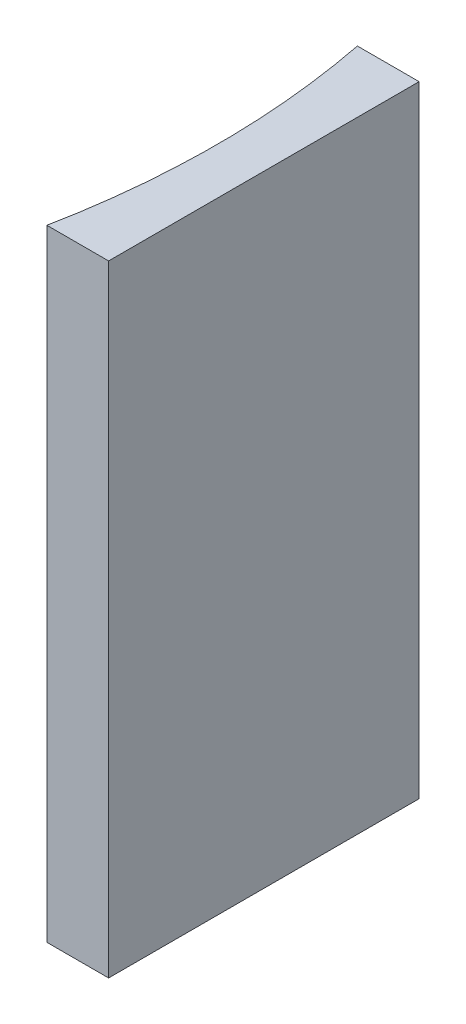
ISO-10303-21;
HEADER;
FILE_DESCRIPTION(('STEP AP214'),'2;1');
FILE_NAME('part.step','',(''),(''),'','','');
FILE_SCHEMA(('AUTOMOTIVE_DESIGN { 1 0 10303 214 1 1 1 1 }'));
ENDSEC;
DATA;
#1=APPLICATION_CONTEXT('core data for automotive mechanical design processes');
#2=APPLICATION_PROTOCOL_DEFINITION('international standard','automotive_design',2000,#1);
#3=PRODUCT_CONTEXT('',#1,'mechanical');
#4=PRODUCT('Part','Part','',(#3));
#5=PRODUCT_RELATED_PRODUCT_CATEGORY('part','',(#4));
#6=PRODUCT_DEFINITION_FORMATION('','',#4);
#7=PRODUCT_DEFINITION_CONTEXT('part definition',#1,'design');
#8=PRODUCT_DEFINITION('design','',#6,#7);
#9=PRODUCT_DEFINITION_SHAPE('','',#8);
#10=(LENGTH_UNIT() NAMED_UNIT(*) SI_UNIT(.MILLI.,.METRE.));
#11=(NAMED_UNIT(*) PLANE_ANGLE_UNIT() SI_UNIT($,.RADIAN.));
#12=(NAMED_UNIT(*) SI_UNIT($,.STERADIAN.) SOLID_ANGLE_UNIT());
#13=UNCERTAINTY_MEASURE_WITH_UNIT(LENGTH_MEASURE(1.E-05),#10,'distance_accuracy_value','');
#14=(GEOMETRIC_REPRESENTATION_CONTEXT(3) GLOBAL_UNCERTAINTY_ASSIGNED_CONTEXT((#13)) GLOBAL_UNIT_ASSIGNED_CONTEXT((#10,
#11,#12)) REPRESENTATION_CONTEXT('',''));
#15=CARTESIAN_POINT('',(0.,0.,0.));
#16=DIRECTION('',(0.,0.,1.));
#17=DIRECTION('',(1.,0.,0.));
#18=AXIS2_PLACEMENT_3D('',#15,#16,#17);
#19=CARTESIAN_POINT('',(0.,40.,0.));
#20=DIRECTION('',(0.,0.,1.));
#21=DIRECTION('',(1.,0.,0.));
#22=AXIS2_PLACEMENT_3D('',#19,#20,#21);
#23=PLANE('',#22);
#24=DIRECTION('',(-1.,0.,0.));
#25=VECTOR('',#24,1.);
#26=CARTESIAN_POINT('',(0.,0.,0.));
#27=LINE('',#26,#25);
#28=CARTESIAN_POINT('',(0.,0.,0.));
#29=VERTEX_POINT('',#28);
#30=CARTESIAN_POINT('',(-3.97672199946043,0.,0.));
#31=VERTEX_POINT('',#30);
#32=EDGE_CURVE('E100',#29,#31,#27,.T.);
#33=ORIENTED_EDGE('',*,*,#32,.T.);
#34=DIRECTION('',(0.,-1.,0.));
#35=VECTOR('',#34,1.);
#36=CARTESIAN_POINT('',(-3.97672199946043,40.,0.));
#37=LINE('',#36,#35);
#38=CARTESIAN_POINT('',(-3.97672199946043,40.,0.));
#39=VERTEX_POINT('',#38);
#40=EDGE_CURVE('E11',#39,#31,#37,.T.);
#41=ORIENTED_EDGE('',*,*,#40,.F.);
#42=DIRECTION('',(-1.,0.,0.));
#43=VECTOR('',#42,1.);
#44=CARTESIAN_POINT('',(0.,40.,0.));
#45=LINE('',#44,#43);
#46=CARTESIAN_POINT('',(0.,40.,0.));
#47=VERTEX_POINT('',#46);
#48=EDGE_CURVE('E88',#47,#39,#45,.T.);
#49=ORIENTED_EDGE('',*,*,#48,.F.);
#50=DIRECTION('',(0.,-1.,0.));
#51=VECTOR('',#50,1.);
#52=CARTESIAN_POINT('',(0.,40.,0.));
#53=LINE('',#52,#51);
#54=EDGE_CURVE('E96',#47,#29,#53,.T.);
#55=ORIENTED_EDGE('',*,*,#54,.T.);
#56=EDGE_LOOP('',(#33,#41,#49,#55));
#57=FACE_BOUND('',#56,.T.);
#58=ADVANCED_FACE('F37',(#57),#23,.F.);
#59=CARTESIAN_POINT('',(-54.68,40.,10.));
#60=DIRECTION('',(0.,-1.,0.));
#61=DIRECTION('',(0.,0.,-1.));
#62=AXIS2_PLACEMENT_3D('',#59,#60,#61);
#63=CYLINDRICAL_SURFACE('',#62,51.68);
#64=CARTESIAN_POINT('',(-54.68,0.,10.));
#65=DIRECTION('',(0.,-1.,0.));
#66=DIRECTION('',(0.,0.,1.));
#67=AXIS2_PLACEMENT_3D('',#64,#65,#66);
#68=CIRCLE('',#67,51.68);
#69=CARTESIAN_POINT('',(-3.97672199946043,0.,20.));
#70=VERTEX_POINT('',#69);
#71=EDGE_CURVE('E92',#31,#70,#68,.T.);
#72=ORIENTED_EDGE('',*,*,#71,.T.);
#73=DIRECTION('',(0.,-1.,0.));
#74=VECTOR('',#73,1.);
#75=CARTESIAN_POINT('',(-3.97672199946043,40.,20.));
#76=LINE('',#75,#74);
#77=CARTESIAN_POINT('',(-3.97672199946043,40.,20.));
#78=VERTEX_POINT('',#77);
#79=EDGE_CURVE('E45',#78,#70,#76,.T.);
#80=ORIENTED_EDGE('',*,*,#79,.F.);
#81=CARTESIAN_POINT('',(-54.68,40.,10.));
#82=DIRECTION('',(0.,-1.,0.));
#83=DIRECTION('',(0.,0.,1.));
#84=AXIS2_PLACEMENT_3D('',#81,#82,#83);
#85=CIRCLE('',#84,51.68);
#86=EDGE_CURVE('E83',#39,#78,#85,.T.);
#87=ORIENTED_EDGE('',*,*,#86,.F.);
#88=ORIENTED_EDGE('',*,*,#40,.T.);
#89=EDGE_LOOP('',(#72,#80,#87,#88));
#90=FACE_BOUND('',#89,.T.);
#91=ADVANCED_FACE('F91',(#90),#63,.F.);
#92=CARTESIAN_POINT('',(0.,40.,20.));
#93=DIRECTION('',(0.,0.,-1.));
#94=DIRECTION('',(-1.,0.,0.));
#95=AXIS2_PLACEMENT_3D('',#92,#93,#94);
#96=PLANE('',#95);
#97=DIRECTION('',(1.,0.,0.));
#98=VECTOR('',#97,1.);
#99=CARTESIAN_POINT('',(0.,0.,20.));
#100=LINE('',#99,#98);
#101=CARTESIAN_POINT('',(0.,0.,20.));
#102=VERTEX_POINT('',#101);
#103=EDGE_CURVE('E70',#70,#102,#100,.T.);
#104=ORIENTED_EDGE('',*,*,#103,.T.);
#105=DIRECTION('',(0.,-1.,0.));
#106=VECTOR('',#105,1.);
#107=CARTESIAN_POINT('',(0.,40.,20.));
#108=LINE('',#107,#106);
#109=CARTESIAN_POINT('',(0.,40.,20.));
#110=VERTEX_POINT('',#109);
#111=EDGE_CURVE('E93',#110,#102,#108,.T.);
#112=ORIENTED_EDGE('',*,*,#111,.F.);
#113=DIRECTION('',(1.,0.,0.));
#114=VECTOR('',#113,1.);
#115=CARTESIAN_POINT('',(0.,40.,20.));
#116=LINE('',#115,#114);
#117=EDGE_CURVE('E86',#78,#110,#116,.T.);
#118=ORIENTED_EDGE('',*,*,#117,.F.);
#119=ORIENTED_EDGE('',*,*,#79,.T.);
#120=EDGE_LOOP('',(#104,#112,#118,#119));
#121=FACE_BOUND('',#120,.T.);
#122=ADVANCED_FACE('F94',(#121),#96,.F.);
#123=CARTESIAN_POINT('',(0.,40.,0.));
#124=DIRECTION('',(-1.,0.,0.));
#125=DIRECTION('',(0.,0.,1.));
#126=AXIS2_PLACEMENT_3D('',#123,#124,#125);
#127=PLANE('',#126);
#128=DIRECTION('',(0.,0.,-1.));
#129=VECTOR('',#128,1.);
#130=CARTESIAN_POINT('',(0.,0.,0.));
#131=LINE('',#130,#129);
#132=EDGE_CURVE('E76',#102,#29,#131,.T.);
#133=ORIENTED_EDGE('',*,*,#132,.T.);
#134=ORIENTED_EDGE('',*,*,#54,.F.);
#135=DIRECTION('',(0.,0.,-1.));
#136=VECTOR('',#135,1.);
#137=CARTESIAN_POINT('',(0.,40.,0.));
#138=LINE('',#137,#136);
#139=EDGE_CURVE('E53',#110,#47,#138,.T.);
#140=ORIENTED_EDGE('',*,*,#139,.F.);
#141=ORIENTED_EDGE('',*,*,#111,.T.);
#142=EDGE_LOOP('',(#133,#134,#140,#141));
#143=FACE_BOUND('',#142,.T.);
#144=ADVANCED_FACE('F107',(#143),#127,.F.);
#145=CARTESIAN_POINT('',(-54.68,40.,10.));
#146=DIRECTION('',(0.,1.,0.));
#147=DIRECTION('',(0.,0.,1.));
#148=AXIS2_PLACEMENT_3D('',#145,#146,#147);
#149=PLANE('',#148);
#150=ORIENTED_EDGE('',*,*,#48,.T.);
#151=ORIENTED_EDGE('',*,*,#86,.T.);
#152=ORIENTED_EDGE('',*,*,#117,.T.);
#153=ORIENTED_EDGE('',*,*,#139,.T.);
#154=EDGE_LOOP('',(#150,#151,#152,#153));
#155=FACE_BOUND('',#154,.T.);
#156=ADVANCED_FACE('F84',(#155),#149,.T.);
#157=CARTESIAN_POINT('',(-54.68,0.,10.));
#158=DIRECTION('',(0.,1.,0.));
#159=DIRECTION('',(0.,0.,1.));
#160=AXIS2_PLACEMENT_3D('',#157,#158,#159);
#161=PLANE('',#160);
#162=ORIENTED_EDGE('',*,*,#32,.F.);
#163=ORIENTED_EDGE('',*,*,#132,.F.);
#164=ORIENTED_EDGE('',*,*,#103,.F.);
#165=ORIENTED_EDGE('',*,*,#71,.F.);
#166=EDGE_LOOP('',(#162,#163,#164,#165));
#167=FACE_BOUND('',#166,.T.);
#168=ADVANCED_FACE('F110',(#167),#161,.F.);
#169=CLOSED_SHELL('',(#58,#91,#122,#144,#156,#168));
#170=MANIFOLD_SOLID_BREP('B2',#169);
#171=ADVANCED_BREP_SHAPE_REPRESENTATION('',(#18,#170),#14);
#172=SHAPE_DEFINITION_REPRESENTATION(#9,#171);
ENDSEC;
END-ISO-10303-21;
